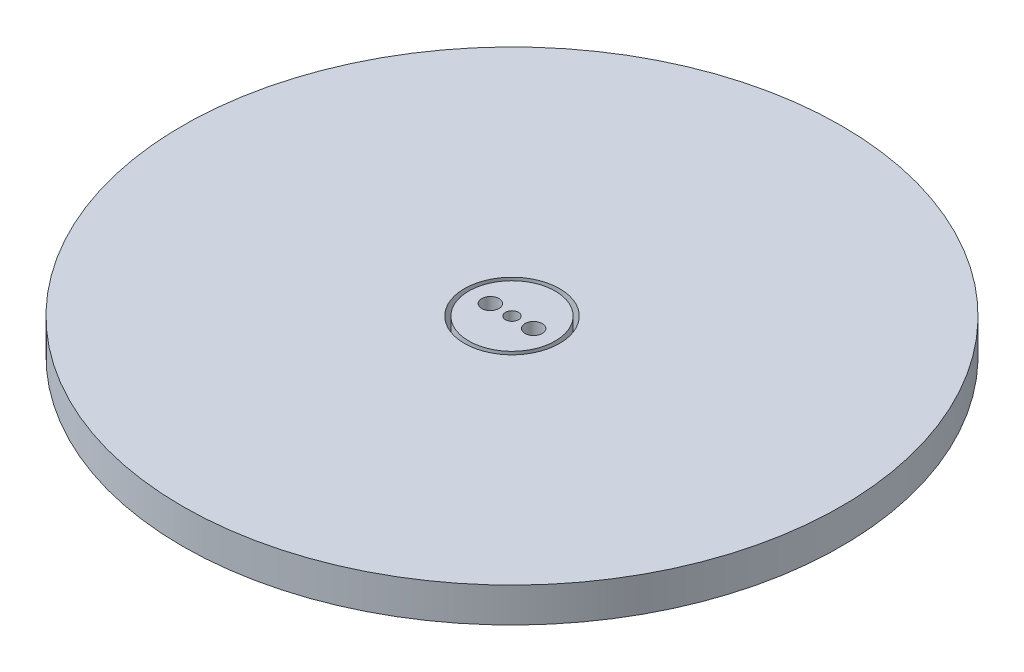
ISO-10303-21;
HEADER;
FILE_DESCRIPTION(('STEP AP214'),'2;1');
FILE_NAME('part.step','',(''),(''),'','','');
FILE_SCHEMA(('AUTOMOTIVE_DESIGN { 1 0 10303 214 1 1 1 1 }'));
ENDSEC;
DATA;
#1=APPLICATION_CONTEXT('core data for automotive mechanical design processes');
#2=APPLICATION_PROTOCOL_DEFINITION('international standard','automotive_design',2000,#1);
#3=PRODUCT_CONTEXT('',#1,'mechanical');
#4=PRODUCT('Part','Part','',(#3));
#5=PRODUCT_RELATED_PRODUCT_CATEGORY('part','',(#4));
#6=PRODUCT_DEFINITION_FORMATION('','',#4);
#7=PRODUCT_DEFINITION_CONTEXT('part definition',#1,'design');
#8=PRODUCT_DEFINITION('design','',#6,#7);
#9=PRODUCT_DEFINITION_SHAPE('','',#8);
#10=(LENGTH_UNIT() NAMED_UNIT(*) SI_UNIT(.MILLI.,.METRE.));
#11=(NAMED_UNIT(*) PLANE_ANGLE_UNIT() SI_UNIT($,.RADIAN.));
#12=(NAMED_UNIT(*) SI_UNIT($,.STERADIAN.) SOLID_ANGLE_UNIT());
#13=UNCERTAINTY_MEASURE_WITH_UNIT(LENGTH_MEASURE(1.E-05),#10,'distance_accuracy_value','');
#14=(GEOMETRIC_REPRESENTATION_CONTEXT(3) GLOBAL_UNCERTAINTY_ASSIGNED_CONTEXT((#13)) GLOBAL_UNIT_ASSIGNED_CONTEXT((#10,
#11,#12)) REPRESENTATION_CONTEXT('',''));
#15=CARTESIAN_POINT('',(0.,0.,0.));
#16=DIRECTION('',(0.,0.,1.));
#17=DIRECTION('',(1.,0.,0.));
#18=AXIS2_PLACEMENT_3D('',#15,#16,#17);
#19=CARTESIAN_POINT('',(0.,109.76307345283,0.));
#20=DIRECTION('',(0.,-1.,0.));
#21=DIRECTION('',(0.,0.,-1.));
#22=AXIS2_PLACEMENT_3D('',#19,#20,#21);
#23=CYLINDRICAL_SURFACE('',#22,38.1);
#24=CARTESIAN_POINT('',(0.,-2.,0.));
#25=DIRECTION('',(0.,-1.,0.));
#26=DIRECTION('',(0.,0.,-1.));
#27=AXIS2_PLACEMENT_3D('',#24,#25,#26);
#28=CIRCLE('',#27,38.1);
#29=CARTESIAN_POINT('',(0.,-2.,-38.1));
#30=VERTEX_POINT('',#29);
#31=EDGE_CURVE('E49',#30,#30,#28,.T.);
#32=ORIENTED_EDGE('',*,*,#31,.F.);
#33=EDGE_LOOP('',(#32));
#34=FACE_BOUND('',#33,.T.);
#35=CARTESIAN_POINT('',(0.,2.,0.));
#36=DIRECTION('',(0.,1.,0.));
#37=DIRECTION('',(0.,0.,1.));
#38=AXIS2_PLACEMENT_3D('',#35,#36,#37);
#39=CIRCLE('',#38,38.1);
#40=CARTESIAN_POINT('',(0.,2.,38.1));
#41=VERTEX_POINT('',#40);
#42=EDGE_CURVE('E58',#41,#41,#39,.F.);
#43=ORIENTED_EDGE('',*,*,#42,.T.);
#44=EDGE_LOOP('',(#43));
#45=FACE_BOUND('',#44,.T.);
#46=ADVANCED_FACE('F42',(#34,#45),#23,.T.);
#47=CARTESIAN_POINT('',(0.,109.76307345283,0.));
#48=DIRECTION('',(0.,-1.,0.));
#49=DIRECTION('',(0.,0.,-1.));
#50=AXIS2_PLACEMENT_3D('',#47,#48,#49);
#51=CYLINDRICAL_SURFACE('',#50,5.5);
#52=CARTESIAN_POINT('',(0.,-2.,0.));
#53=DIRECTION('',(0.,-1.,0.));
#54=DIRECTION('',(0.,0.,-1.));
#55=AXIS2_PLACEMENT_3D('',#52,#53,#54);
#56=CIRCLE('',#55,5.5);
#57=CARTESIAN_POINT('',(0.,-2.,-5.5));
#58=VERTEX_POINT('',#57);
#59=EDGE_CURVE('E53',#58,#58,#56,.T.);
#60=ORIENTED_EDGE('',*,*,#59,.T.);
#61=EDGE_LOOP('',(#60));
#62=FACE_BOUND('',#61,.T.);
#63=CARTESIAN_POINT('',(0.,2.,0.));
#64=DIRECTION('',(0.,1.,0.));
#65=DIRECTION('',(0.,0.,1.));
#66=AXIS2_PLACEMENT_3D('',#63,#64,#65);
#67=CIRCLE('',#66,5.5);
#68=CARTESIAN_POINT('',(0.,2.,5.5));
#69=VERTEX_POINT('',#68);
#70=EDGE_CURVE('E11',#69,#69,#67,.F.);
#71=ORIENTED_EDGE('',*,*,#70,.F.);
#72=EDGE_LOOP('',(#71));
#73=FACE_BOUND('',#72,.T.);
#74=ADVANCED_FACE('F69',(#62,#73),#51,.F.);
#75=CARTESIAN_POINT('',(0.,-2.,0.));
#76=DIRECTION('',(0.,-1.,0.));
#77=DIRECTION('',(0.,0.,-1.));
#78=AXIS2_PLACEMENT_3D('',#75,#76,#77);
#79=PLANE('',#78);
#80=ORIENTED_EDGE('',*,*,#59,.F.);
#81=EDGE_LOOP('',(#80));
#82=FACE_BOUND('',#81,.T.);
#83=ORIENTED_EDGE('',*,*,#31,.T.);
#84=EDGE_LOOP('',(#83));
#85=FACE_BOUND('',#84,.T.);
#86=ADVANCED_FACE('F65',(#82,#85),#79,.T.);
#87=CARTESIAN_POINT('',(0.,2.,0.));
#88=DIRECTION('',(0.,1.,0.));
#89=DIRECTION('',(0.,0.,1.));
#90=AXIS2_PLACEMENT_3D('',#87,#88,#89);
#91=PLANE('',#90);
#92=ORIENTED_EDGE('',*,*,#42,.F.);
#93=EDGE_LOOP('',(#92));
#94=FACE_BOUND('',#93,.T.);
#95=ORIENTED_EDGE('',*,*,#70,.T.);
#96=EDGE_LOOP('',(#95));
#97=FACE_BOUND('',#96,.T.);
#98=ADVANCED_FACE('F44',(#94,#97),#91,.T.);
#99=CLOSED_SHELL('',(#46,#74,#86,#98));
#100=MANIFOLD_SOLID_BREP('B2',#99);
#101=CARTESIAN_POINT('',(0.,2.,0.));
#102=DIRECTION('',(0.,1.,0.));
#103=DIRECTION('',(0.,0.,1.));
#104=AXIS2_PLACEMENT_3D('',#101,#102,#103);
#105=PLANE('',#104);
#106=CARTESIAN_POINT('',(-2.5,2.,0.));
#107=DIRECTION('',(0.,1.,0.));
#108=DIRECTION('',(0.,0.,1.));
#109=AXIS2_PLACEMENT_3D('',#106,#107,#108);
#110=CIRCLE('',#109,1.);
#111=CARTESIAN_POINT('',(-2.5,2.,1.));
#112=VERTEX_POINT('',#111);
#113=EDGE_CURVE('E119',#112,#112,#110,.T.);
#114=ORIENTED_EDGE('',*,*,#113,.F.);
#115=EDGE_LOOP('',(#114));
#116=FACE_BOUND('',#115,.T.);
#117=CARTESIAN_POINT('',(0.,2.,0.));
#118=DIRECTION('',(0.,1.,0.));
#119=DIRECTION('',(0.,0.,1.));
#120=AXIS2_PLACEMENT_3D('',#117,#118,#119);
#121=CIRCLE('',#120,5.);
#122=CARTESIAN_POINT('',(0.,2.,5.));
#123=VERTEX_POINT('',#122);
#124=EDGE_CURVE('E41',#123,#123,#121,.T.);
#125=ORIENTED_EDGE('',*,*,#124,.T.);
#126=EDGE_LOOP('',(#125));
#127=FACE_BOUND('',#126,.T.);
#128=CARTESIAN_POINT('',(0.,2.,0.));
#129=DIRECTION('',(0.,1.,0.));
#130=DIRECTION('',(0.,0.,1.));
#131=AXIS2_PLACEMENT_3D('',#128,#129,#130);
#132=CIRCLE('',#131,0.75);
#133=CARTESIAN_POINT('',(0.,2.,0.75));
#134=VERTEX_POINT('',#133);
#135=EDGE_CURVE('E114',#134,#134,#132,.T.);
#136=ORIENTED_EDGE('',*,*,#135,.F.);
#137=EDGE_LOOP('',(#136));
#138=FACE_BOUND('',#137,.T.);
#139=CARTESIAN_POINT('',(2.5,2.,0.));
#140=DIRECTION('',(0.,1.,0.));
#141=DIRECTION('',(0.,0.,-1.));
#142=AXIS2_PLACEMENT_3D('',#139,#140,#141);
#143=CIRCLE('',#142,1.);
#144=CARTESIAN_POINT('',(2.5,2.,-1.));
#145=VERTEX_POINT('',#144);
#146=EDGE_CURVE('E125',#145,#145,#143,.T.);
#147=ORIENTED_EDGE('',*,*,#146,.F.);
#148=EDGE_LOOP('',(#147));
#149=FACE_BOUND('',#148,.T.);
#150=ADVANCED_FACE('F103',(#116,#127,#138,#149),#105,.T.);
#151=CARTESIAN_POINT('',(0.,-2.,0.));
#152=DIRECTION('',(0.,1.,0.));
#153=DIRECTION('',(0.,0.,1.));
#154=AXIS2_PLACEMENT_3D('',#151,#152,#153);
#155=PLANE('',#154);
#156=CARTESIAN_POINT('',(0.,-2.,0.));
#157=DIRECTION('',(0.,1.,0.));
#158=DIRECTION('',(0.,0.,1.));
#159=AXIS2_PLACEMENT_3D('',#156,#157,#158);
#160=CIRCLE('',#159,5.);
#161=CARTESIAN_POINT('',(0.,-2.,5.));
#162=VERTEX_POINT('',#161);
#163=EDGE_CURVE('E107',#162,#162,#160,.T.);
#164=ORIENTED_EDGE('',*,*,#163,.F.);
#165=EDGE_LOOP('',(#164));
#166=FACE_BOUND('',#165,.T.);
#167=CARTESIAN_POINT('',(0.,-2.,0.));
#168=DIRECTION('',(0.,1.,0.));
#169=DIRECTION('',(0.,0.,1.));
#170=AXIS2_PLACEMENT_3D('',#167,#168,#169);
#171=CIRCLE('',#170,0.75);
#172=CARTESIAN_POINT('',(0.,-2.,0.75));
#173=VERTEX_POINT('',#172);
#174=EDGE_CURVE('E116',#173,#173,#171,.T.);
#175=ORIENTED_EDGE('',*,*,#174,.T.);
#176=EDGE_LOOP('',(#175));
#177=FACE_BOUND('',#176,.T.);
#178=CARTESIAN_POINT('',(-2.5,-2.,0.));
#179=DIRECTION('',(0.,1.,0.));
#180=DIRECTION('',(0.,0.,1.));
#181=AXIS2_PLACEMENT_3D('',#178,#179,#180);
#182=CIRCLE('',#181,1.);
#183=CARTESIAN_POINT('',(-2.5,-2.,1.));
#184=VERTEX_POINT('',#183);
#185=EDGE_CURVE('E122',#184,#184,#182,.T.);
#186=ORIENTED_EDGE('',*,*,#185,.T.);
#187=EDGE_LOOP('',(#186));
#188=FACE_BOUND('',#187,.T.);
#189=CARTESIAN_POINT('',(2.5,-2.,0.));
#190=DIRECTION('',(0.,1.,0.));
#191=DIRECTION('',(0.,0.,-1.));
#192=AXIS2_PLACEMENT_3D('',#189,#190,#191);
#193=CIRCLE('',#192,1.);
#194=CARTESIAN_POINT('',(2.5,-2.,-1.));
#195=VERTEX_POINT('',#194);
#196=EDGE_CURVE('E128',#195,#195,#193,.T.);
#197=ORIENTED_EDGE('',*,*,#196,.T.);
#198=EDGE_LOOP('',(#197));
#199=FACE_BOUND('',#198,.T.);
#200=ADVANCED_FACE('F138',(#166,#177,#188,#199),#155,.F.);
#201=CARTESIAN_POINT('',(0.,2.,0.));
#202=DIRECTION('',(0.,-1.,0.));
#203=DIRECTION('',(0.,0.,-1.));
#204=AXIS2_PLACEMENT_3D('',#201,#202,#203);
#205=CYLINDRICAL_SURFACE('',#204,5.);
#206=ORIENTED_EDGE('',*,*,#124,.F.);
#207=EDGE_LOOP('',(#206));
#208=FACE_BOUND('',#207,.T.);
#209=ORIENTED_EDGE('',*,*,#163,.T.);
#210=EDGE_LOOP('',(#209));
#211=FACE_BOUND('',#210,.T.);
#212=ADVANCED_FACE('F105',(#208,#211),#205,.T.);
#213=CARTESIAN_POINT('',(0.,2.,0.));
#214=DIRECTION('',(0.,-1.,0.));
#215=DIRECTION('',(0.,0.,-1.));
#216=AXIS2_PLACEMENT_3D('',#213,#214,#215);
#217=CYLINDRICAL_SURFACE('',#216,0.75);
#218=ORIENTED_EDGE('',*,*,#135,.T.);
#219=EDGE_LOOP('',(#218));
#220=FACE_BOUND('',#219,.T.);
#221=ORIENTED_EDGE('',*,*,#174,.F.);
#222=EDGE_LOOP('',(#221));
#223=FACE_BOUND('',#222,.T.);
#224=ADVANCED_FACE('F147',(#220,#223),#217,.F.);
#225=CARTESIAN_POINT('',(-2.5,2.,0.));
#226=DIRECTION('',(0.,-1.,0.));
#227=DIRECTION('',(0.,0.,-1.));
#228=AXIS2_PLACEMENT_3D('',#225,#226,#227);
#229=CYLINDRICAL_SURFACE('',#228,1.);
#230=ORIENTED_EDGE('',*,*,#113,.T.);
#231=EDGE_LOOP('',(#230));
#232=FACE_BOUND('',#231,.T.);
#233=ORIENTED_EDGE('',*,*,#185,.F.);
#234=EDGE_LOOP('',(#233));
#235=FACE_BOUND('',#234,.T.);
#236=ADVANCED_FACE('F150',(#232,#235),#229,.F.);
#237=CARTESIAN_POINT('',(2.5,2.,0.));
#238=DIRECTION('',(0.,-1.,0.));
#239=DIRECTION('',(0.,0.,-1.));
#240=AXIS2_PLACEMENT_3D('',#237,#238,#239);
#241=CYLINDRICAL_SURFACE('',#240,1.);
#242=ORIENTED_EDGE('',*,*,#146,.T.);
#243=EDGE_LOOP('',(#242));
#244=FACE_BOUND('',#243,.T.);
#245=ORIENTED_EDGE('',*,*,#196,.F.);
#246=EDGE_LOOP('',(#245));
#247=FACE_BOUND('',#246,.T.);
#248=ADVANCED_FACE('F134',(#244,#247),#241,.F.);
#249=CLOSED_SHELL('',(#150,#200,#212,#224,#236,#248));
#250=MANIFOLD_SOLID_BREP('B6',#249);
#251=ADVANCED_BREP_SHAPE_REPRESENTATION('',(#18,#100,#250),#14);
#252=SHAPE_DEFINITION_REPRESENTATION(#9,#251);
ENDSEC;
END-ISO-10303-21;
